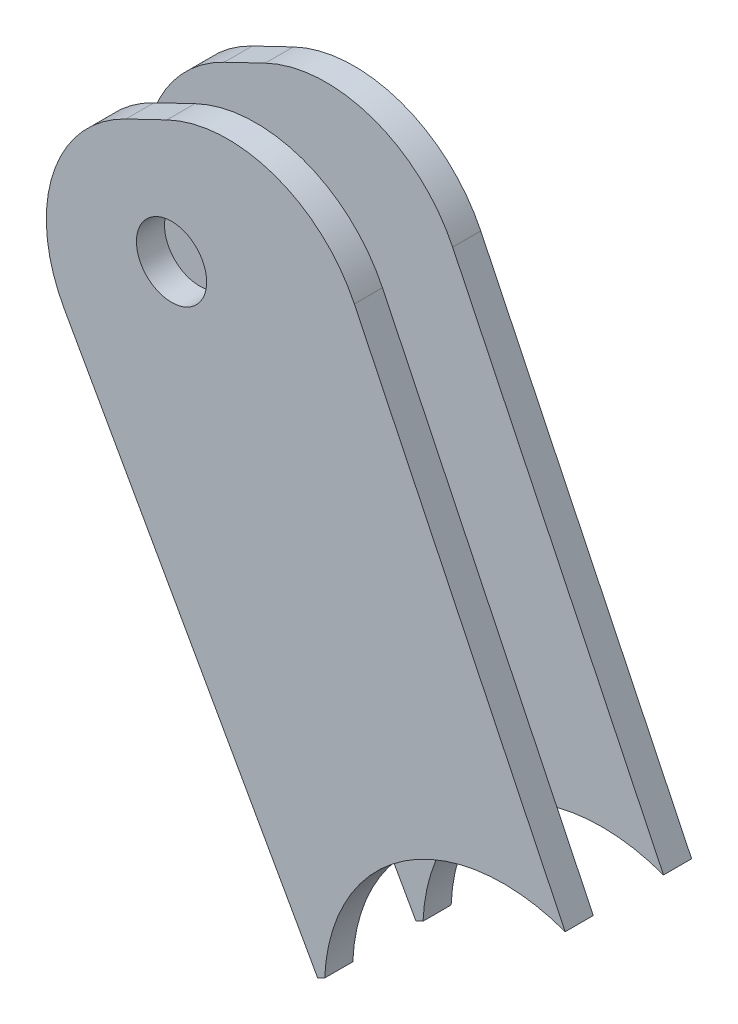
ISO-10303-21;
HEADER;
FILE_DESCRIPTION(('STEP AP214'),'2;1');
FILE_NAME('part.step','',(''),(''),'','','');
FILE_SCHEMA(('AUTOMOTIVE_DESIGN { 1 0 10303 214 1 1 1 1 }'));
ENDSEC;
DATA;
#1=APPLICATION_CONTEXT('core data for automotive mechanical design processes');
#2=APPLICATION_PROTOCOL_DEFINITION('international standard','automotive_design',2000,#1);
#3=PRODUCT_CONTEXT('',#1,'mechanical');
#4=PRODUCT('Part','Part','',(#3));
#5=PRODUCT_RELATED_PRODUCT_CATEGORY('part','',(#4));
#6=PRODUCT_DEFINITION_FORMATION('','',#4);
#7=PRODUCT_DEFINITION_CONTEXT('part definition',#1,'design');
#8=PRODUCT_DEFINITION('design','',#6,#7);
#9=PRODUCT_DEFINITION_SHAPE('','',#8);
#10=(LENGTH_UNIT() NAMED_UNIT(*) SI_UNIT(.MILLI.,.METRE.));
#11=(NAMED_UNIT(*) PLANE_ANGLE_UNIT() SI_UNIT($,.RADIAN.));
#12=(NAMED_UNIT(*) SI_UNIT($,.STERADIAN.) SOLID_ANGLE_UNIT());
#13=UNCERTAINTY_MEASURE_WITH_UNIT(LENGTH_MEASURE(1.E-05),#10,'distance_accuracy_value','');
#14=(GEOMETRIC_REPRESENTATION_CONTEXT(3) GLOBAL_UNCERTAINTY_ASSIGNED_CONTEXT((#13)) GLOBAL_UNIT_ASSIGNED_CONTEXT((#10,
#11,#12)) REPRESENTATION_CONTEXT('',''));
#15=CARTESIAN_POINT('',(0.,0.,0.));
#16=DIRECTION('',(0.,0.,1.));
#17=DIRECTION('',(1.,0.,0.));
#18=AXIS2_PLACEMENT_3D('',#15,#16,#17);
#19=CARTESIAN_POINT('',(211.866954819544,210.226139875916,-7.));
#20=DIRECTION('',(0.,0.,-1.));
#21=DIRECTION('',(-1.,0.,0.));
#22=AXIS2_PLACEMENT_3D('',#19,#20,#21);
#23=PLANE('',#22);
#24=CARTESIAN_POINT('',(234.421204701867,172.795325306794,-7.));
#25=DIRECTION('',(0.,0.,-1.));
#26=DIRECTION('',(-1.,0.,0.));
#27=AXIS2_PLACEMENT_3D('',#24,#25,#26);
#28=CIRCLE('',#27,12.7458474253196);
#29=CARTESIAN_POINT('',(221.68738383472,173.348888955287,-7.));
#30=VERTEX_POINT('',#29);
#31=CARTESIAN_POINT('',(238.810781533645,184.761454247577,-7.));
#32=VERTEX_POINT('',#31);
#33=EDGE_CURVE('E167',#30,#32,#28,.T.);
#34=ORIENTED_EDGE('',*,*,#33,.F.);
#35=DIRECTION('',(-0.901138631511086,-0.433531044791867,0.));
#36=VECTOR('',#35,1.);
#37=CARTESIAN_POINT('',(240.051018031475,182.183495797239,-7.));
#38=LINE('',#37,#36);
#39=CARTESIAN_POINT('',(221.183345822055,173.106400043366,-7.));
#40=VERTEX_POINT('',#39);
#41=EDGE_CURVE('E131',#30,#40,#38,.T.);
#42=ORIENTED_EDGE('',*,*,#41,.T.);
#43=DIRECTION('',(-0.488409141194116,0.872614755088422,0.));
#44=VECTOR('',#43,1.);
#45=CARTESIAN_POINT('',(221.183345822055,173.106400043366,-7.));
#46=LINE('',#45,#44);
#47=CARTESIAN_POINT('',(203.140807268659,205.342048463975,-7.));
#48=VERTEX_POINT('',#47);
#49=EDGE_CURVE('E68',#40,#48,#46,.T.);
#50=ORIENTED_EDGE('',*,*,#49,.T.);
#51=CARTESIAN_POINT('',(211.866954819544,210.226139875916,-7.));
#52=DIRECTION('',(0.,0.,-1.));
#53=DIRECTION('',(-1.,0.,0.));
#54=AXIS2_PLACEMENT_3D('',#51,#52,#53);
#55=CIRCLE('',#54,9.99999999999998);
#56=CARTESIAN_POINT('',(207.531644371625,219.237526191027,-7.));
#57=VERTEX_POINT('',#56);
#58=EDGE_CURVE('E150',#48,#57,#55,.T.);
#59=ORIENTED_EDGE('',*,*,#58,.T.);
#60=DIRECTION('',(0.901138631511083,0.433531044791873,0.));
#61=VECTOR('',#60,1.);
#62=CARTESIAN_POINT('',(207.531644371625,219.237526191027,-7.));
#63=LINE('',#62,#61);
#64=CARTESIAN_POINT('',(210.451686213704,220.642336445926,-7.));
#65=VERTEX_POINT('',#64);
#66=EDGE_CURVE('E101',#57,#65,#63,.T.);
#67=ORIENTED_EDGE('',*,*,#66,.T.);
#68=CARTESIAN_POINT('',(214.786996661623,211.630950130815,-7.));
#69=DIRECTION('',(0.,0.,-1.));
#70=DIRECTION('',(-1.,0.,0.));
#71=AXIS2_PLACEMENT_3D('',#68,#69,#70);
#72=CIRCLE('',#71,10.);
#73=CARTESIAN_POINT('',(223.798382976734,215.966260578734,-7.));
#74=VERTEX_POINT('',#73);
#75=EDGE_CURVE('E108',#65,#74,#72,.T.);
#76=ORIENTED_EDGE('',*,*,#75,.T.);
#77=DIRECTION('',(0.433531044791866,-0.901138631511086,0.));
#78=VECTOR('',#77,1.);
#79=CARTESIAN_POINT('',(223.798382976734,215.966260578734,-7.));
#80=LINE('',#79,#78);
#81=EDGE_CURVE('E113',#74,#32,#80,.T.);
#82=ORIENTED_EDGE('',*,*,#81,.T.);
#83=EDGE_LOOP('',(#34,#42,#50,#59,#67,#76,#82));
#84=FACE_BOUND('',#83,.T.);
#85=CARTESIAN_POINT('',(210.781303050667,212.057553234732,-7.));
#86=DIRECTION('',(0.,0.,-1.));
#87=DIRECTION('',(-1.,0.,0.));
#88=AXIS2_PLACEMENT_3D('',#85,#86,#87);
#89=CIRCLE('',#88,2.5);
#90=CARTESIAN_POINT('',(208.281303050667,212.057553234732,-7.));
#91=VERTEX_POINT('',#90);
#92=EDGE_CURVE('E142',#91,#91,#89,.T.);
#93=ORIENTED_EDGE('',*,*,#92,.F.);
#94=EDGE_LOOP('',(#93));
#95=FACE_BOUND('',#94,.T.);
#96=ADVANCED_FACE('F45',(#84,#95),#23,.T.);
#97=CARTESIAN_POINT('',(211.866954819544,210.226139875916,-5.));
#98=DIRECTION('',(0.,0.,-1.));
#99=DIRECTION('',(-1.,0.,0.));
#100=AXIS2_PLACEMENT_3D('',#97,#98,#99);
#101=PLANE('',#100);
#102=DIRECTION('',(-0.901138631511086,-0.433531044791867,0.));
#103=VECTOR('',#102,1.);
#104=CARTESIAN_POINT('',(240.051018031475,182.183495797239,-5.));
#105=LINE('',#104,#103);
#106=CARTESIAN_POINT('',(221.68738383472,173.348888955287,-5.));
#107=VERTEX_POINT('',#106);
#108=CARTESIAN_POINT('',(221.183345822055,173.106400043366,-5.));
#109=VERTEX_POINT('',#108);
#110=EDGE_CURVE('E147',#107,#109,#105,.T.);
#111=ORIENTED_EDGE('',*,*,#110,.F.);
#112=CARTESIAN_POINT('',(234.421204701867,172.795325306794,-5.));
#113=DIRECTION('',(0.,0.,-1.));
#114=DIRECTION('',(-1.,0.,0.));
#115=AXIS2_PLACEMENT_3D('',#112,#113,#114);
#116=CIRCLE('',#115,12.7458474253196);
#117=CARTESIAN_POINT('',(238.810781533645,184.761454247577,-5.));
#118=VERTEX_POINT('',#117);
#119=EDGE_CURVE('E60',#107,#118,#116,.T.);
#120=ORIENTED_EDGE('',*,*,#119,.T.);
#121=DIRECTION('',(0.433531044791866,-0.901138631511086,0.));
#122=VECTOR('',#121,1.);
#123=CARTESIAN_POINT('',(223.798382976734,215.966260578734,-5.));
#124=LINE('',#123,#122);
#125=CARTESIAN_POINT('',(223.798382976734,215.966260578734,-5.));
#126=VERTEX_POINT('',#125);
#127=EDGE_CURVE('E145',#126,#118,#124,.T.);
#128=ORIENTED_EDGE('',*,*,#127,.F.);
#129=CARTESIAN_POINT('',(214.786996661623,211.630950130815,-5.));
#130=DIRECTION('',(0.,0.,-1.));
#131=DIRECTION('',(-1.,0.,0.));
#132=AXIS2_PLACEMENT_3D('',#129,#130,#131);
#133=CIRCLE('',#132,10.);
#134=CARTESIAN_POINT('',(210.451686213704,220.642336445926,-5.));
#135=VERTEX_POINT('',#134);
#136=EDGE_CURVE('E121',#135,#126,#133,.T.);
#137=ORIENTED_EDGE('',*,*,#136,.F.);
#138=DIRECTION('',(0.901138631511083,0.433531044791873,0.));
#139=VECTOR('',#138,1.);
#140=CARTESIAN_POINT('',(207.531644371625,219.237526191027,-5.));
#141=LINE('',#140,#139);
#142=CARTESIAN_POINT('',(207.531644371625,219.237526191027,-5.));
#143=VERTEX_POINT('',#142);
#144=EDGE_CURVE('E141',#143,#135,#141,.T.);
#145=ORIENTED_EDGE('',*,*,#144,.F.);
#146=CARTESIAN_POINT('',(211.866954819544,210.226139875916,-5.));
#147=DIRECTION('',(0.,0.,-1.));
#148=DIRECTION('',(-1.,0.,0.));
#149=AXIS2_PLACEMENT_3D('',#146,#147,#148);
#150=CIRCLE('',#149,9.99999999999998);
#151=CARTESIAN_POINT('',(203.140807268659,205.342048463975,-5.));
#152=VERTEX_POINT('',#151);
#153=EDGE_CURVE('E138',#152,#143,#150,.T.);
#154=ORIENTED_EDGE('',*,*,#153,.F.);
#155=DIRECTION('',(-0.488409141194116,0.872614755088422,0.));
#156=VECTOR('',#155,1.);
#157=CARTESIAN_POINT('',(221.183345822055,173.106400043366,-5.));
#158=LINE('',#157,#156);
#159=EDGE_CURVE('E92',#109,#152,#158,.T.);
#160=ORIENTED_EDGE('',*,*,#159,.F.);
#161=EDGE_LOOP('',(#111,#120,#128,#137,#145,#154,#160));
#162=FACE_BOUND('',#161,.T.);
#163=CARTESIAN_POINT('',(210.781303050667,212.057553234732,-5.));
#164=DIRECTION('',(0.,0.,-1.));
#165=DIRECTION('',(-1.,0.,0.));
#166=AXIS2_PLACEMENT_3D('',#163,#164,#165);
#167=CIRCLE('',#166,2.5);
#168=CARTESIAN_POINT('',(208.281303050667,212.057553234732,-5.));
#169=VERTEX_POINT('',#168);
#170=EDGE_CURVE('E176',#169,#169,#167,.T.);
#171=ORIENTED_EDGE('',*,*,#170,.T.);
#172=EDGE_LOOP('',(#171));
#173=FACE_BOUND('',#172,.T.);
#174=ADVANCED_FACE('F160',(#162,#173),#101,.F.);
#175=CARTESIAN_POINT('',(211.866954819544,210.226139875916,-7.));
#176=DIRECTION('',(0.,0.,1.));
#177=DIRECTION('',(1.,0.,0.));
#178=AXIS2_PLACEMENT_3D('',#175,#176,#177);
#179=CYLINDRICAL_SURFACE('',#178,9.99999999999998);
#180=ORIENTED_EDGE('',*,*,#153,.T.);
#181=DIRECTION('',(0.,0.,1.));
#182=VECTOR('',#181,1.);
#183=CARTESIAN_POINT('',(207.531644371625,219.237526191027,-7.));
#184=LINE('',#183,#182);
#185=EDGE_CURVE('E53',#57,#143,#184,.T.);
#186=ORIENTED_EDGE('',*,*,#185,.F.);
#187=ORIENTED_EDGE('',*,*,#58,.F.);
#188=DIRECTION('',(0.,0.,1.));
#189=VECTOR('',#188,1.);
#190=CARTESIAN_POINT('',(203.140807268659,205.342048463975,-7.));
#191=LINE('',#190,#189);
#192=EDGE_CURVE('E137',#48,#152,#191,.T.);
#193=ORIENTED_EDGE('',*,*,#192,.T.);
#194=EDGE_LOOP('',(#180,#186,#187,#193));
#195=FACE_BOUND('',#194,.T.);
#196=ADVANCED_FACE('F47',(#195),#179,.T.);
#197=CARTESIAN_POINT('',(207.531644371625,219.237526191027,-7.));
#198=DIRECTION('',(0.433531044791873,-0.901138631511083,0.));
#199=DIRECTION('',(0.901138631511083,0.433531044791873,0.));
#200=AXIS2_PLACEMENT_3D('',#197,#198,#199);
#201=PLANE('',#200);
#202=ORIENTED_EDGE('',*,*,#144,.T.);
#203=DIRECTION('',(0.,0.,1.));
#204=VECTOR('',#203,1.);
#205=CARTESIAN_POINT('',(210.451686213704,220.642336445926,-7.));
#206=LINE('',#205,#204);
#207=EDGE_CURVE('E125',#65,#135,#206,.T.);
#208=ORIENTED_EDGE('',*,*,#207,.F.);
#209=ORIENTED_EDGE('',*,*,#66,.F.);
#210=ORIENTED_EDGE('',*,*,#185,.T.);
#211=EDGE_LOOP('',(#202,#208,#209,#210));
#212=FACE_BOUND('',#211,.T.);
#213=ADVANCED_FACE('F154',(#212),#201,.F.);
#214=CARTESIAN_POINT('',(214.786996661623,211.630950130815,-7.));
#215=DIRECTION('',(0.,0.,1.));
#216=DIRECTION('',(1.,0.,0.));
#217=AXIS2_PLACEMENT_3D('',#214,#215,#216);
#218=CYLINDRICAL_SURFACE('',#217,10.);
#219=ORIENTED_EDGE('',*,*,#136,.T.);
#220=DIRECTION('',(0.,0.,1.));
#221=VECTOR('',#220,1.);
#222=CARTESIAN_POINT('',(223.798382976734,215.966260578734,-7.));
#223=LINE('',#222,#221);
#224=EDGE_CURVE('E118',#74,#126,#223,.T.);
#225=ORIENTED_EDGE('',*,*,#224,.F.);
#226=ORIENTED_EDGE('',*,*,#75,.F.);
#227=ORIENTED_EDGE('',*,*,#207,.T.);
#228=EDGE_LOOP('',(#219,#225,#226,#227));
#229=FACE_BOUND('',#228,.T.);
#230=ADVANCED_FACE('F119',(#229),#218,.T.);
#231=CARTESIAN_POINT('',(223.798382976734,215.966260578734,-7.));
#232=DIRECTION('',(-0.901138631511086,-0.433531044791866,0.));
#233=DIRECTION('',(0.433531044791866,-0.901138631511086,0.));
#234=AXIS2_PLACEMENT_3D('',#231,#232,#233);
#235=PLANE('',#234);
#236=ORIENTED_EDGE('',*,*,#127,.T.);
#237=DIRECTION('',(0.,0.,1.));
#238=VECTOR('',#237,1.);
#239=CARTESIAN_POINT('',(238.810781533645,184.761454247577,-10.));
#240=LINE('',#239,#238);
#241=EDGE_CURVE('E130',#118,#32,#240,.F.);
#242=ORIENTED_EDGE('',*,*,#241,.T.);
#243=ORIENTED_EDGE('',*,*,#81,.F.);
#244=ORIENTED_EDGE('',*,*,#224,.T.);
#245=EDGE_LOOP('',(#236,#242,#243,#244));
#246=FACE_BOUND('',#245,.T.);
#247=ADVANCED_FACE('F129',(#246),#235,.F.);
#248=CARTESIAN_POINT('',(240.051018031475,182.183495797239,-7.));
#249=DIRECTION('',(-0.433531044791867,0.901138631511086,0.));
#250=DIRECTION('',(-0.901138631511086,-0.433531044791867,0.));
#251=AXIS2_PLACEMENT_3D('',#248,#249,#250);
#252=PLANE('',#251);
#253=ORIENTED_EDGE('',*,*,#41,.F.);
#254=DIRECTION('',(0.,0.,1.));
#255=VECTOR('',#254,1.);
#256=CARTESIAN_POINT('',(221.68738383472,173.348888955287,-10.));
#257=LINE('',#256,#255);
#258=EDGE_CURVE('E12',#30,#107,#257,.T.);
#259=ORIENTED_EDGE('',*,*,#258,.T.);
#260=ORIENTED_EDGE('',*,*,#110,.T.);
#261=DIRECTION('',(0.,0.,1.));
#262=VECTOR('',#261,1.);
#263=CARTESIAN_POINT('',(221.183345822055,173.106400043366,-7.));
#264=LINE('',#263,#262);
#265=EDGE_CURVE('E126',#40,#109,#264,.T.);
#266=ORIENTED_EDGE('',*,*,#265,.F.);
#267=EDGE_LOOP('',(#253,#259,#260,#266));
#268=FACE_BOUND('',#267,.T.);
#269=ADVANCED_FACE('F172',(#268),#252,.F.);
#270=CARTESIAN_POINT('',(221.183345822055,173.106400043366,-7.));
#271=DIRECTION('',(0.872614755088422,0.488409141194116,0.));
#272=DIRECTION('',(-0.488409141194116,0.872614755088422,0.));
#273=AXIS2_PLACEMENT_3D('',#270,#271,#272);
#274=PLANE('',#273);
#275=ORIENTED_EDGE('',*,*,#159,.T.);
#276=ORIENTED_EDGE('',*,*,#192,.F.);
#277=ORIENTED_EDGE('',*,*,#49,.F.);
#278=ORIENTED_EDGE('',*,*,#265,.T.);
#279=EDGE_LOOP('',(#275,#276,#277,#278));
#280=FACE_BOUND('',#279,.T.);
#281=ADVANCED_FACE('F173',(#280),#274,.F.);
#282=CARTESIAN_POINT('',(210.781303050667,212.057553234732,-7.));
#283=DIRECTION('',(0.,0.,1.));
#284=DIRECTION('',(1.,0.,0.));
#285=AXIS2_PLACEMENT_3D('',#282,#283,#284);
#286=CYLINDRICAL_SURFACE('',#285,2.5);
#287=ORIENTED_EDGE('',*,*,#92,.T.);
#288=EDGE_LOOP('',(#287));
#289=FACE_BOUND('',#288,.T.);
#290=ORIENTED_EDGE('',*,*,#170,.F.);
#291=EDGE_LOOP('',(#290));
#292=FACE_BOUND('',#291,.T.);
#293=ADVANCED_FACE('F184',(#289,#292),#286,.F.);
#294=CARTESIAN_POINT('',(234.421204701867,172.795325306794,-10.));
#295=DIRECTION('',(0.,0.,1.));
#296=DIRECTION('',(1.,0.,0.));
#297=AXIS2_PLACEMENT_3D('',#294,#295,#296);
#298=CYLINDRICAL_SURFACE('',#297,12.7458474253196);
#299=ORIENTED_EDGE('',*,*,#119,.F.);
#300=ORIENTED_EDGE('',*,*,#258,.F.);
#301=ORIENTED_EDGE('',*,*,#33,.T.);
#302=ORIENTED_EDGE('',*,*,#241,.F.);
#303=EDGE_LOOP('',(#299,#300,#301,#302));
#304=FACE_BOUND('',#303,.T.);
#305=ADVANCED_FACE('F166',(#304),#298,.F.);
#306=CLOSED_SHELL('',(#96,#174,#196,#213,#230,#247,#269,#281,#293,#305));
#307=MANIFOLD_SOLID_BREP('B2',#306);
#308=CARTESIAN_POINT('',(211.866954819544,210.226139875916,2.));
#309=DIRECTION('',(0.,0.,1.));
#310=DIRECTION('',(1.,0.,0.));
#311=AXIS2_PLACEMENT_3D('',#308,#309,#310);
#312=PLANE('',#311);
#313=CARTESIAN_POINT('',(234.421204701867,172.795325306794,2.));
#314=DIRECTION('',(0.,0.,1.));
#315=DIRECTION('',(1.,0.,0.));
#316=AXIS2_PLACEMENT_3D('',#313,#314,#315);
#317=CIRCLE('',#316,12.7458474253196);
#318=CARTESIAN_POINT('',(238.810781533645,184.761454247577,2.));
#319=VERTEX_POINT('',#318);
#320=CARTESIAN_POINT('',(221.68738383472,173.348888955287,2.));
#321=VERTEX_POINT('',#320);
#322=EDGE_CURVE('E399',#319,#321,#317,.T.);
#323=ORIENTED_EDGE('',*,*,#322,.F.);
#324=DIRECTION('',(-0.433531044791866,0.901138631511086,0.));
#325=VECTOR('',#324,1.);
#326=CARTESIAN_POINT('',(223.798382976734,215.966260578734,2.));
#327=LINE('',#326,#325);
#328=CARTESIAN_POINT('',(223.798382976734,215.966260578734,2.));
#329=VERTEX_POINT('',#328);
#330=EDGE_CURVE('E323',#319,#329,#327,.T.);
#331=ORIENTED_EDGE('',*,*,#330,.T.);
#332=CARTESIAN_POINT('',(214.786996661623,211.630950130815,2.));
#333=DIRECTION('',(0.,0.,1.));
#334=DIRECTION('',(-1.,0.,0.));
#335=AXIS2_PLACEMENT_3D('',#332,#333,#334);
#336=CIRCLE('',#335,9.99999999999999);
#337=CARTESIAN_POINT('',(210.451686213704,220.642336445926,2.));
#338=VERTEX_POINT('',#337);
#339=EDGE_CURVE('E337',#329,#338,#336,.T.);
#340=ORIENTED_EDGE('',*,*,#339,.T.);
#341=DIRECTION('',(-0.901138631511086,-0.433531044791866,0.));
#342=VECTOR('',#341,1.);
#343=CARTESIAN_POINT('',(207.531644371625,219.237526191027,2.));
#344=LINE('',#343,#342);
#345=CARTESIAN_POINT('',(207.531644371625,219.237526191027,2.));
#346=VERTEX_POINT('',#345);
#347=EDGE_CURVE('E330',#338,#346,#344,.T.);
#348=ORIENTED_EDGE('',*,*,#347,.T.);
#349=CARTESIAN_POINT('',(211.866954819544,210.226139875916,2.));
#350=DIRECTION('',(0.,0.,1.));
#351=DIRECTION('',(1.,0.,0.));
#352=AXIS2_PLACEMENT_3D('',#349,#350,#351);
#353=CIRCLE('',#352,9.99999999999998);
#354=CARTESIAN_POINT('',(203.140807268659,205.342048463975,2.));
#355=VERTEX_POINT('',#354);
#356=EDGE_CURVE('E334',#346,#355,#353,.T.);
#357=ORIENTED_EDGE('',*,*,#356,.T.);
#358=DIRECTION('',(0.488409141194116,-0.872614755088422,0.));
#359=VECTOR('',#358,1.);
#360=CARTESIAN_POINT('',(221.183345822055,173.106400043366,2.));
#361=LINE('',#360,#359);
#362=CARTESIAN_POINT('',(221.183345822055,173.106400043366,2.));
#363=VERTEX_POINT('',#362);
#364=EDGE_CURVE('E291',#355,#363,#361,.T.);
#365=ORIENTED_EDGE('',*,*,#364,.T.);
#366=DIRECTION('',(0.901138631511086,0.433531044791867,0.));
#367=VECTOR('',#366,1.);
#368=CARTESIAN_POINT('',(240.051018031475,182.183495797239,2.));
#369=LINE('',#368,#367);
#370=EDGE_CURVE('E370',#363,#321,#369,.T.);
#371=ORIENTED_EDGE('',*,*,#370,.T.);
#372=EDGE_LOOP('',(#323,#331,#340,#348,#357,#365,#371));
#373=FACE_BOUND('',#372,.T.);
#374=CARTESIAN_POINT('',(210.781303050667,212.057553234732,2.));
#375=DIRECTION('',(0.,0.,1.));
#376=DIRECTION('',(1.,0.,0.));
#377=AXIS2_PLACEMENT_3D('',#374,#375,#376);
#378=CIRCLE('',#377,2.5);
#379=CARTESIAN_POINT('',(213.281303050667,212.057553234732,2.));
#380=VERTEX_POINT('',#379);
#381=EDGE_CURVE('E362',#380,#380,#378,.T.);
#382=ORIENTED_EDGE('',*,*,#381,.F.);
#383=EDGE_LOOP('',(#382));
#384=FACE_BOUND('',#383,.T.);
#385=ADVANCED_FACE('F268',(#373,#384),#312,.T.);
#386=CARTESIAN_POINT('',(211.866954819544,210.226139875916,0.));
#387=DIRECTION('',(0.,0.,1.));
#388=DIRECTION('',(1.,0.,0.));
#389=AXIS2_PLACEMENT_3D('',#386,#387,#388);
#390=PLANE('',#389);
#391=DIRECTION('',(-0.433531044791866,0.901138631511086,0.));
#392=VECTOR('',#391,1.);
#393=CARTESIAN_POINT('',(223.798382976734,215.966260578734,0.));
#394=LINE('',#393,#392);
#395=CARTESIAN_POINT('',(238.810781533645,184.761454247577,0.));
#396=VERTEX_POINT('',#395);
#397=CARTESIAN_POINT('',(223.798382976734,215.966260578734,0.));
#398=VERTEX_POINT('',#397);
#399=EDGE_CURVE('E361',#396,#398,#394,.T.);
#400=ORIENTED_EDGE('',*,*,#399,.F.);
#401=CARTESIAN_POINT('',(234.421204701867,172.795325306794,0.));
#402=DIRECTION('',(0.,0.,1.));
#403=DIRECTION('',(1.,0.,0.));
#404=AXIS2_PLACEMENT_3D('',#401,#402,#403);
#405=CIRCLE('',#404,12.7458474253196);
#406=CARTESIAN_POINT('',(221.68738383472,173.348888955287,0.));
#407=VERTEX_POINT('',#406);
#408=EDGE_CURVE('E283',#396,#407,#405,.T.);
#409=ORIENTED_EDGE('',*,*,#408,.T.);
#410=DIRECTION('',(0.901138631511086,0.433531044791867,0.));
#411=VECTOR('',#410,1.);
#412=CARTESIAN_POINT('',(240.051018031475,182.183495797239,0.));
#413=LINE('',#412,#411);
#414=CARTESIAN_POINT('',(221.183345822055,173.106400043366,0.));
#415=VERTEX_POINT('',#414);
#416=EDGE_CURVE('E358',#415,#407,#413,.T.);
#417=ORIENTED_EDGE('',*,*,#416,.F.);
#418=DIRECTION('',(0.488409141194116,-0.872614755088422,0.));
#419=VECTOR('',#418,1.);
#420=CARTESIAN_POINT('',(221.183345822055,173.106400043366,0.));
#421=LINE('',#420,#419);
#422=CARTESIAN_POINT('',(203.140807268659,205.342048463975,0.));
#423=VERTEX_POINT('',#422);
#424=EDGE_CURVE('E315',#423,#415,#421,.T.);
#425=ORIENTED_EDGE('',*,*,#424,.F.);
#426=CARTESIAN_POINT('',(211.866954819544,210.226139875916,0.));
#427=DIRECTION('',(0.,0.,1.));
#428=DIRECTION('',(1.,0.,0.));
#429=AXIS2_PLACEMENT_3D('',#426,#427,#428);
#430=CIRCLE('',#429,9.99999999999998);
#431=CARTESIAN_POINT('',(207.531644371625,219.237526191027,0.));
#432=VERTEX_POINT('',#431);
#433=EDGE_CURVE('E367',#432,#423,#430,.T.);
#434=ORIENTED_EDGE('',*,*,#433,.F.);
#435=DIRECTION('',(-0.901138631511086,-0.433531044791866,0.));
#436=VECTOR('',#435,1.);
#437=CARTESIAN_POINT('',(207.531644371625,219.237526191027,0.));
#438=LINE('',#437,#436);
#439=CARTESIAN_POINT('',(210.451686213704,220.642336445926,0.));
#440=VERTEX_POINT('',#439);
#441=EDGE_CURVE('E346',#440,#432,#438,.T.);
#442=ORIENTED_EDGE('',*,*,#441,.F.);
#443=CARTESIAN_POINT('',(214.786996661623,211.630950130815,0.));
#444=DIRECTION('',(0.,0.,1.));
#445=DIRECTION('',(-1.,0.,0.));
#446=AXIS2_PLACEMENT_3D('',#443,#444,#445);
#447=CIRCLE('',#446,9.99999999999999);
#448=EDGE_CURVE('E364',#398,#440,#447,.T.);
#449=ORIENTED_EDGE('',*,*,#448,.F.);
#450=EDGE_LOOP('',(#400,#409,#417,#425,#434,#442,#449));
#451=FACE_BOUND('',#450,.T.);
#452=CARTESIAN_POINT('',(210.781303050667,212.057553234732,0.));
#453=DIRECTION('',(0.,0.,1.));
#454=DIRECTION('',(1.,0.,0.));
#455=AXIS2_PLACEMENT_3D('',#452,#453,#454);
#456=CIRCLE('',#455,2.5);
#457=CARTESIAN_POINT('',(213.281303050667,212.057553234732,0.));
#458=VERTEX_POINT('',#457);
#459=EDGE_CURVE('E392',#458,#458,#456,.T.);
#460=ORIENTED_EDGE('',*,*,#459,.T.);
#461=EDGE_LOOP('',(#460));
#462=FACE_BOUND('',#461,.T.);
#463=ADVANCED_FACE('F380',(#451,#462),#390,.F.);
#464=CARTESIAN_POINT('',(240.051018031475,182.183495797239,2.));
#465=DIRECTION('',(-0.433531044791867,0.901138631511086,0.));
#466=DIRECTION('',(-0.901138631511086,-0.433531044791867,0.));
#467=AXIS2_PLACEMENT_3D('',#464,#465,#466);
#468=PLANE('',#467);
#469=ORIENTED_EDGE('',*,*,#416,.T.);
#470=DIRECTION('',(0.,0.,1.));
#471=VECTOR('',#470,1.);
#472=CARTESIAN_POINT('',(221.68738383472,173.348888955287,-10.));
#473=LINE('',#472,#471);
#474=EDGE_CURVE('E388',#407,#321,#473,.T.);
#475=ORIENTED_EDGE('',*,*,#474,.T.);
#476=ORIENTED_EDGE('',*,*,#370,.F.);
#477=DIRECTION('',(0.,0.,-1.));
#478=VECTOR('',#477,1.);
#479=CARTESIAN_POINT('',(221.183345822055,173.106400043366,2.));
#480=LINE('',#479,#478);
#481=EDGE_CURVE('E354',#363,#415,#480,.T.);
#482=ORIENTED_EDGE('',*,*,#481,.T.);
#483=EDGE_LOOP('',(#469,#475,#476,#482));
#484=FACE_BOUND('',#483,.T.);
#485=ADVANCED_FACE('F270',(#484),#468,.F.);
#486=CARTESIAN_POINT('',(223.798382976734,215.966260578734,2.));
#487=DIRECTION('',(-0.901138631511086,-0.433531044791866,0.));
#488=DIRECTION('',(0.433531044791866,-0.901138631511086,0.));
#489=AXIS2_PLACEMENT_3D('',#486,#487,#488);
#490=PLANE('',#489);
#491=ORIENTED_EDGE('',*,*,#330,.F.);
#492=DIRECTION('',(0.,0.,1.));
#493=VECTOR('',#492,1.);
#494=CARTESIAN_POINT('',(238.810781533645,184.761454247577,-10.));
#495=LINE('',#494,#493);
#496=EDGE_CURVE('E43',#319,#396,#495,.F.);
#497=ORIENTED_EDGE('',*,*,#496,.T.);
#498=ORIENTED_EDGE('',*,*,#399,.T.);
#499=DIRECTION('',(0.,0.,-1.));
#500=VECTOR('',#499,1.);
#501=CARTESIAN_POINT('',(223.798382976734,215.966260578734,2.));
#502=LINE('',#501,#500);
#503=EDGE_CURVE('E276',#329,#398,#502,.T.);
#504=ORIENTED_EDGE('',*,*,#503,.F.);
#505=EDGE_LOOP('',(#491,#497,#498,#504));
#506=FACE_BOUND('',#505,.T.);
#507=ADVANCED_FACE('F404',(#506),#490,.F.);
#508=CARTESIAN_POINT('',(214.786996661623,211.630950130815,2.));
#509=DIRECTION('',(0.,0.,-1.));
#510=DIRECTION('',(-1.,0.,0.));
#511=AXIS2_PLACEMENT_3D('',#508,#509,#510);
#512=CYLINDRICAL_SURFACE('',#511,9.99999999999999);
#513=ORIENTED_EDGE('',*,*,#448,.T.);
#514=DIRECTION('',(0.,0.,-1.));
#515=VECTOR('',#514,1.);
#516=CARTESIAN_POINT('',(210.451686213704,220.642336445926,2.));
#517=LINE('',#516,#515);
#518=EDGE_CURVE('E349',#338,#440,#517,.T.);
#519=ORIENTED_EDGE('',*,*,#518,.F.);
#520=ORIENTED_EDGE('',*,*,#339,.F.);
#521=ORIENTED_EDGE('',*,*,#503,.T.);
#522=EDGE_LOOP('',(#513,#519,#520,#521));
#523=FACE_BOUND('',#522,.T.);
#524=ADVANCED_FACE('F376',(#523),#512,.T.);
#525=CARTESIAN_POINT('',(207.531644371625,219.237526191027,2.));
#526=DIRECTION('',(0.433531044791866,-0.901138631511086,0.));
#527=DIRECTION('',(0.901138631511086,0.433531044791866,0.));
#528=AXIS2_PLACEMENT_3D('',#525,#526,#527);
#529=PLANE('',#528);
#530=ORIENTED_EDGE('',*,*,#441,.T.);
#531=DIRECTION('',(0.,0.,-1.));
#532=VECTOR('',#531,1.);
#533=CARTESIAN_POINT('',(207.531644371625,219.237526191027,2.));
#534=LINE('',#533,#532);
#535=EDGE_CURVE('E343',#346,#432,#534,.T.);
#536=ORIENTED_EDGE('',*,*,#535,.F.);
#537=ORIENTED_EDGE('',*,*,#347,.F.);
#538=ORIENTED_EDGE('',*,*,#518,.T.);
#539=EDGE_LOOP('',(#530,#536,#537,#538));
#540=FACE_BOUND('',#539,.T.);
#541=ADVANCED_FACE('F344',(#540),#529,.F.);
#542=CARTESIAN_POINT('',(211.866954819544,210.226139875916,2.));
#543=DIRECTION('',(0.,0.,-1.));
#544=DIRECTION('',(-1.,0.,0.));
#545=AXIS2_PLACEMENT_3D('',#542,#543,#544);
#546=CYLINDRICAL_SURFACE('',#545,9.99999999999998);
#547=ORIENTED_EDGE('',*,*,#433,.T.);
#548=DIRECTION('',(0.,0.,-1.));
#549=VECTOR('',#548,1.);
#550=CARTESIAN_POINT('',(203.140807268659,205.342048463975,2.));
#551=LINE('',#550,#549);
#552=EDGE_CURVE('E350',#355,#423,#551,.T.);
#553=ORIENTED_EDGE('',*,*,#552,.F.);
#554=ORIENTED_EDGE('',*,*,#356,.F.);
#555=ORIENTED_EDGE('',*,*,#535,.T.);
#556=EDGE_LOOP('',(#547,#553,#554,#555));
#557=FACE_BOUND('',#556,.T.);
#558=ADVANCED_FACE('F352',(#557),#546,.T.);
#559=CARTESIAN_POINT('',(221.183345822055,173.106400043366,2.));
#560=DIRECTION('',(0.872614755088422,0.488409141194116,0.));
#561=DIRECTION('',(-0.488409141194116,0.872614755088422,0.));
#562=AXIS2_PLACEMENT_3D('',#559,#560,#561);
#563=PLANE('',#562);
#564=ORIENTED_EDGE('',*,*,#424,.T.);
#565=ORIENTED_EDGE('',*,*,#481,.F.);
#566=ORIENTED_EDGE('',*,*,#364,.F.);
#567=ORIENTED_EDGE('',*,*,#552,.T.);
#568=EDGE_LOOP('',(#564,#565,#566,#567));
#569=FACE_BOUND('',#568,.T.);
#570=ADVANCED_FACE('F383',(#569),#563,.F.);
#571=CARTESIAN_POINT('',(210.781303050667,212.057553234732,2.));
#572=DIRECTION('',(0.,0.,-1.));
#573=DIRECTION('',(-1.,0.,0.));
#574=AXIS2_PLACEMENT_3D('',#571,#572,#573);
#575=CYLINDRICAL_SURFACE('',#574,2.5);
#576=ORIENTED_EDGE('',*,*,#381,.T.);
#577=EDGE_LOOP('',(#576));
#578=FACE_BOUND('',#577,.T.);
#579=ORIENTED_EDGE('',*,*,#459,.F.);
#580=EDGE_LOOP('',(#579));
#581=FACE_BOUND('',#580,.T.);
#582=ADVANCED_FACE('F418',(#578,#581),#575,.F.);
#583=CARTESIAN_POINT('',(234.421204701867,172.795325306794,-10.));
#584=DIRECTION('',(0.,0.,1.));
#585=DIRECTION('',(1.,0.,0.));
#586=AXIS2_PLACEMENT_3D('',#583,#584,#585);
#587=CYLINDRICAL_SURFACE('',#586,12.7458474253196);
#588=ORIENTED_EDGE('',*,*,#408,.F.);
#589=ORIENTED_EDGE('',*,*,#496,.F.);
#590=ORIENTED_EDGE('',*,*,#322,.T.);
#591=ORIENTED_EDGE('',*,*,#474,.F.);
#592=EDGE_LOOP('',(#588,#589,#590,#591));
#593=FACE_BOUND('',#592,.T.);
#594=ADVANCED_FACE('F401',(#593),#587,.F.);
#595=CLOSED_SHELL('',(#385,#463,#485,#507,#524,#541,#558,#570,#582,#594));
#596=MANIFOLD_SOLID_BREP('B6',#595);
#597=ADVANCED_BREP_SHAPE_REPRESENTATION('',(#18,#307,#596),#14);
#598=SHAPE_DEFINITION_REPRESENTATION(#9,#597);
ENDSEC;
END-ISO-10303-21;
